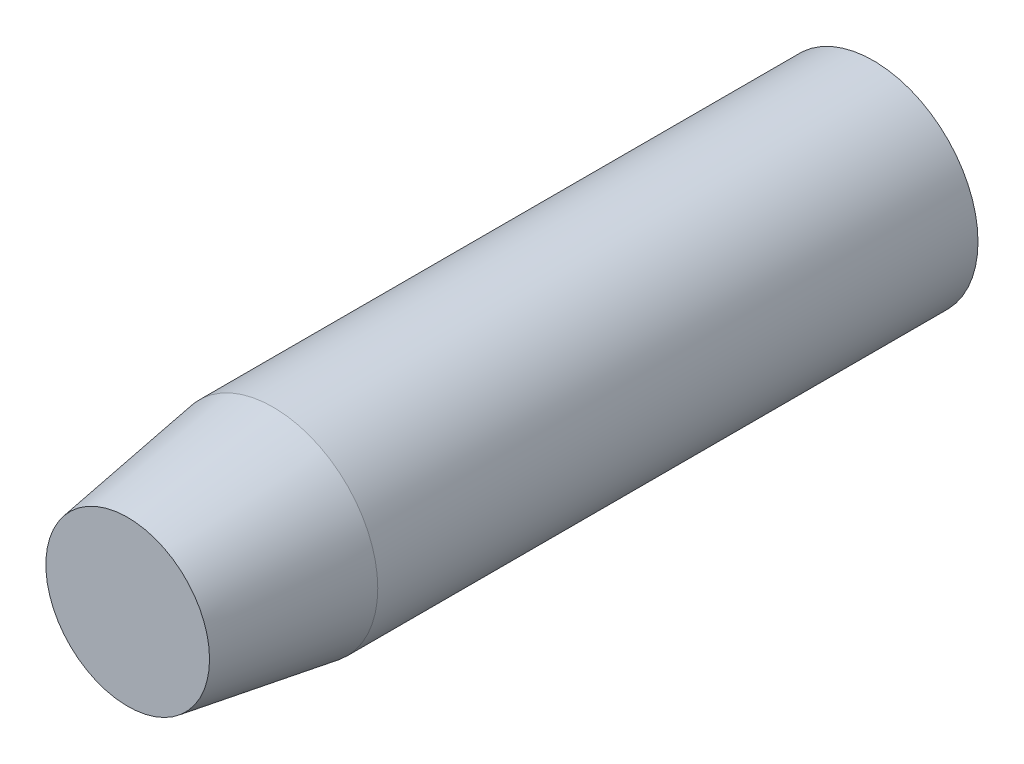
ISO-10303-21;
HEADER;
FILE_DESCRIPTION(('STEP AP214'),'2;1');
FILE_NAME('part.step','',(''),(''),'','','');
FILE_SCHEMA(('AUTOMOTIVE_DESIGN { 1 0 10303 214 1 1 1 1 }'));
ENDSEC;
DATA;
#1=APPLICATION_CONTEXT('core data for automotive mechanical design processes');
#2=APPLICATION_PROTOCOL_DEFINITION('international standard','automotive_design',2000,#1);
#3=PRODUCT_CONTEXT('',#1,'mechanical');
#4=PRODUCT('Part','Part','',(#3));
#5=PRODUCT_RELATED_PRODUCT_CATEGORY('part','',(#4));
#6=PRODUCT_DEFINITION_FORMATION('','',#4);
#7=PRODUCT_DEFINITION_CONTEXT('part definition',#1,'design');
#8=PRODUCT_DEFINITION('design','',#6,#7);
#9=PRODUCT_DEFINITION_SHAPE('','',#8);
#10=(LENGTH_UNIT() NAMED_UNIT(*) SI_UNIT(.MILLI.,.METRE.));
#11=(NAMED_UNIT(*) PLANE_ANGLE_UNIT() SI_UNIT($,.RADIAN.));
#12=(NAMED_UNIT(*) SI_UNIT($,.STERADIAN.) SOLID_ANGLE_UNIT());
#13=UNCERTAINTY_MEASURE_WITH_UNIT(LENGTH_MEASURE(1.E-05),#10,'distance_accuracy_value','');
#14=(GEOMETRIC_REPRESENTATION_CONTEXT(3) GLOBAL_UNCERTAINTY_ASSIGNED_CONTEXT((#13)) GLOBAL_UNIT_ASSIGNED_CONTEXT((#10,
#11,#12)) REPRESENTATION_CONTEXT('',''));
#15=CARTESIAN_POINT('',(0.,0.,0.));
#16=DIRECTION('',(0.,0.,1.));
#17=DIRECTION('',(1.,0.,0.));
#18=AXIS2_PLACEMENT_3D('',#15,#16,#17);
#19=CARTESIAN_POINT('',(0.,0.,65.0875));
#20=DIRECTION('',(0.,0.,-1.));
#21=DIRECTION('',(-1.,0.,0.));
#22=AXIS2_PLACEMENT_3D('',#19,#20,#21);
#23=CYLINDRICAL_SURFACE('',#22,18.25625);
#24=CARTESIAN_POINT('',(0.,0.,39.6874999999998));
#25=DIRECTION('',(0.,0.,1.));
#26=DIRECTION('',(1.,0.,0.));
#27=AXIS2_PLACEMENT_3D('',#24,#25,#26);
#28=CIRCLE('',#27,18.25625);
#29=CARTESIAN_POINT('',(18.25625,0.,39.6874999999998));
#30=VERTEX_POINT('',#29);
#31=EDGE_CURVE('E10',#30,#30,#28,.F.);
#32=ORIENTED_EDGE('',*,*,#31,.T.);
#33=EDGE_LOOP('',(#32));
#34=FACE_BOUND('',#33,.T.);
#35=CARTESIAN_POINT('',(0.,0.,-65.0875));
#36=DIRECTION('',(0.,0.,1.));
#37=DIRECTION('',(1.,0.,0.));
#38=AXIS2_PLACEMENT_3D('',#35,#36,#37);
#39=CIRCLE('',#38,18.25625);
#40=CARTESIAN_POINT('',(18.25625,0.,-65.0875));
#41=VERTEX_POINT('',#40);
#42=EDGE_CURVE('E41',#41,#41,#39,.T.);
#43=ORIENTED_EDGE('',*,*,#42,.T.);
#44=EDGE_LOOP('',(#43));
#45=FACE_BOUND('',#44,.T.);
#46=ADVANCED_FACE('F30',(#34,#45),#23,.T.);
#47=CARTESIAN_POINT('',(0.,0.,65.0875));
#48=DIRECTION('',(0.,0.,1.));
#49=DIRECTION('',(1.,0.,0.));
#50=AXIS2_PLACEMENT_3D('',#47,#48,#49);
#51=PLANE('',#50);
#52=CARTESIAN_POINT('',(0.,0.,65.0875));
#53=DIRECTION('',(0.,0.,1.));
#54=DIRECTION('',(1.,0.,0.));
#55=AXIS2_PLACEMENT_3D('',#52,#53,#54);
#56=CIRCLE('',#55,14.2875000000001);
#57=CARTESIAN_POINT('',(14.2875000000001,0.,65.0875));
#58=VERTEX_POINT('',#57);
#59=EDGE_CURVE('E37',#58,#58,#56,.T.);
#60=ORIENTED_EDGE('',*,*,#59,.T.);
#61=EDGE_LOOP('',(#60));
#62=FACE_BOUND('',#61,.T.);
#63=ADVANCED_FACE('F51',(#62),#51,.T.);
#64=CARTESIAN_POINT('',(0.,0.,-65.0875));
#65=DIRECTION('',(0.,0.,1.));
#66=DIRECTION('',(1.,0.,0.));
#67=AXIS2_PLACEMENT_3D('',#64,#65,#66);
#68=PLANE('',#67);
#69=ORIENTED_EDGE('',*,*,#42,.F.);
#70=EDGE_LOOP('',(#69));
#71=FACE_BOUND('',#70,.T.);
#72=ADVANCED_FACE('F49',(#71),#68,.F.);
#73=CARTESIAN_POINT('',(0.,0.,65.0875));
#74=DIRECTION('',(0.,0.,-1.));
#75=DIRECTION('',(-1.,0.,0.));
#76=AXIS2_PLACEMENT_3D('',#73,#74,#75);
#77=CONICAL_SURFACE('',#76,14.2875000000001,0.154996741923938);
#78=ORIENTED_EDGE('',*,*,#31,.F.);
#79=EDGE_LOOP('',(#78));
#80=FACE_BOUND('',#79,.T.);
#81=ORIENTED_EDGE('',*,*,#59,.F.);
#82=EDGE_LOOP('',(#81));
#83=FACE_BOUND('',#82,.T.);
#84=ADVANCED_FACE('F32',(#80,#83),#77,.T.);
#85=CLOSED_SHELL('',(#46,#63,#72,#84));
#86=MANIFOLD_SOLID_BREP('B2',#85);
#87=ADVANCED_BREP_SHAPE_REPRESENTATION('',(#18,#86),#14);
#88=SHAPE_DEFINITION_REPRESENTATION(#9,#87);
ENDSEC;
END-ISO-10303-21;
